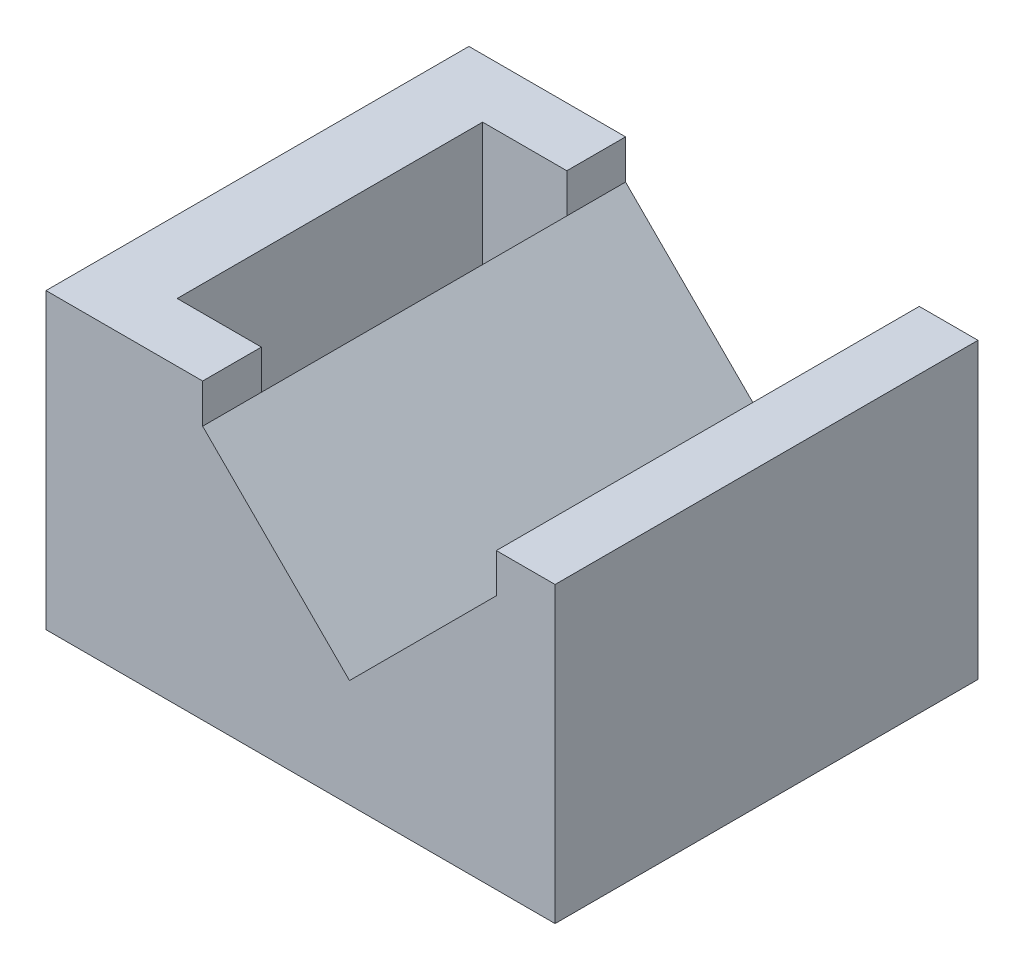
ISO-10303-21;
HEADER;
FILE_DESCRIPTION(('STEP AP214'),'2;1');
FILE_NAME('part.step','',(''),(''),'','','');
FILE_SCHEMA(('AUTOMOTIVE_DESIGN { 1 0 10303 214 1 1 1 1 }'));
ENDSEC;
DATA;
#1=APPLICATION_CONTEXT('core data for automotive mechanical design processes');
#2=APPLICATION_PROTOCOL_DEFINITION('international standard','automotive_design',2000,#1);
#3=PRODUCT_CONTEXT('',#1,'mechanical');
#4=PRODUCT('Part','Part','',(#3));
#5=PRODUCT_RELATED_PRODUCT_CATEGORY('part','',(#4));
#6=PRODUCT_DEFINITION_FORMATION('','',#4);
#7=PRODUCT_DEFINITION_CONTEXT('part definition',#1,'design');
#8=PRODUCT_DEFINITION('design','',#6,#7);
#9=PRODUCT_DEFINITION_SHAPE('','',#8);
#10=(LENGTH_UNIT() NAMED_UNIT(*) SI_UNIT(.MILLI.,.METRE.));
#11=(NAMED_UNIT(*) PLANE_ANGLE_UNIT() SI_UNIT($,.RADIAN.));
#12=(NAMED_UNIT(*) SI_UNIT($,.STERADIAN.) SOLID_ANGLE_UNIT());
#13=UNCERTAINTY_MEASURE_WITH_UNIT(LENGTH_MEASURE(1.E-05),#10,'distance_accuracy_value','');
#14=(GEOMETRIC_REPRESENTATION_CONTEXT(3) GLOBAL_UNCERTAINTY_ASSIGNED_CONTEXT((#13)) GLOBAL_UNIT_ASSIGNED_CONTEXT((#10,
#11,#12)) REPRESENTATION_CONTEXT('',''));
#15=CARTESIAN_POINT('',(0.,0.,0.));
#16=DIRECTION('',(0.,0.,1.));
#17=DIRECTION('',(1.,0.,0.));
#18=AXIS2_PLACEMENT_3D('',#15,#16,#17);
#19=CARTESIAN_POINT('',(8.,13.,25.));
#20=DIRECTION('',(-1.,0.,0.));
#21=DIRECTION('',(0.,-1.,0.));
#22=AXIS2_PLACEMENT_3D('',#19,#20,#21);
#23=PLANE('',#22);
#24=DIRECTION('',(0.,0.,-1.));
#25=VECTOR('',#24,1.);
#26=CARTESIAN_POINT('',(7.99999999999999,15.,25.));
#27=LINE('',#26,#25);
#28=CARTESIAN_POINT('',(7.99999999999999,15.,10.8));
#29=VERTEX_POINT('',#28);
#30=CARTESIAN_POINT('',(8.,15.,7.8));
#31=VERTEX_POINT('',#30);
#32=EDGE_CURVE('E305',#29,#31,#27,.T.);
#33=ORIENTED_EDGE('',*,*,#32,.F.);
#34=DIRECTION('',(0.,-1.,0.));
#35=VECTOR('',#34,1.);
#36=CARTESIAN_POINT('',(8.,13.,10.8));
#37=LINE('',#36,#35);
#38=CARTESIAN_POINT('',(8.,13.,10.8));
#39=VERTEX_POINT('',#38);
#40=EDGE_CURVE('E224',#29,#39,#37,.T.);
#41=ORIENTED_EDGE('',*,*,#40,.T.);
#42=DIRECTION('',(0.,0.,-1.));
#43=VECTOR('',#42,1.);
#44=CARTESIAN_POINT('',(8.,13.,25.));
#45=LINE('',#44,#43);
#46=CARTESIAN_POINT('',(8.,13.,7.8));
#47=VERTEX_POINT('',#46);
#48=EDGE_CURVE('E308',#39,#47,#45,.T.);
#49=ORIENTED_EDGE('',*,*,#48,.T.);
#50=DIRECTION('',(0.,1.,0.));
#51=VECTOR('',#50,1.);
#52=CARTESIAN_POINT('',(8.,0.,7.8));
#53=LINE('',#52,#51);
#54=EDGE_CURVE('E274',#47,#31,#53,.T.);
#55=ORIENTED_EDGE('',*,*,#54,.T.);
#56=EDGE_LOOP('',(#33,#41,#49,#55));
#57=FACE_BOUND('',#56,.T.);
#58=ADVANCED_FACE('F33',(#57),#23,.F.);
#59=CARTESIAN_POINT('',(26.,0.,25.));
#60=DIRECTION('',(-1.,0.,0.));
#61=DIRECTION('',(0.,0.,1.));
#62=AXIS2_PLACEMENT_3D('',#59,#60,#61);
#63=PLANE('',#62);
#64=DIRECTION('',(0.,0.,-1.));
#65=VECTOR('',#64,1.);
#66=CARTESIAN_POINT('',(26.,0.,25.));
#67=LINE('',#66,#65);
#68=CARTESIAN_POINT('',(26.,0.,10.8));
#69=VERTEX_POINT('',#68);
#70=CARTESIAN_POINT('',(26.,0.,-10.8));
#71=VERTEX_POINT('',#70);
#72=EDGE_CURVE('E295',#69,#71,#67,.T.);
#73=ORIENTED_EDGE('',*,*,#72,.T.);
#74=DIRECTION('',(0.,1.,0.));
#75=VECTOR('',#74,1.);
#76=CARTESIAN_POINT('',(26.,0.,-10.8));
#77=LINE('',#76,#75);
#78=CARTESIAN_POINT('',(26.,15.,-10.8));
#79=VERTEX_POINT('',#78);
#80=EDGE_CURVE('E211',#71,#79,#77,.T.);
#81=ORIENTED_EDGE('',*,*,#80,.T.);
#82=DIRECTION('',(0.,0.,-1.));
#83=VECTOR('',#82,1.);
#84=CARTESIAN_POINT('',(26.,15.,25.));
#85=LINE('',#84,#83);
#86=CARTESIAN_POINT('',(26.,15.,10.8));
#87=VERTEX_POINT('',#86);
#88=EDGE_CURVE('E11',#87,#79,#85,.T.);
#89=ORIENTED_EDGE('',*,*,#88,.F.);
#90=DIRECTION('',(0.,1.,0.));
#91=VECTOR('',#90,1.);
#92=CARTESIAN_POINT('',(26.,0.,10.8));
#93=LINE('',#92,#91);
#94=EDGE_CURVE('E218',#69,#87,#93,.T.);
#95=ORIENTED_EDGE('',*,*,#94,.F.);
#96=EDGE_LOOP('',(#73,#81,#89,#95));
#97=FACE_BOUND('',#96,.T.);
#98=ADVANCED_FACE('F35',(#97),#63,.F.);
#99=CARTESIAN_POINT('',(23.,15.,25.));
#100=DIRECTION('',(0.,-1.,0.));
#101=DIRECTION('',(1.,0.,0.));
#102=AXIS2_PLACEMENT_3D('',#99,#100,#101);
#103=PLANE('',#102);
#104=ORIENTED_EDGE('',*,*,#88,.T.);
#105=DIRECTION('',(-1.,0.,0.));
#106=VECTOR('',#105,1.);
#107=CARTESIAN_POINT('',(23.,15.,-10.8));
#108=LINE('',#107,#106);
#109=CARTESIAN_POINT('',(23.,15.,-10.8));
#110=VERTEX_POINT('',#109);
#111=EDGE_CURVE('E254',#79,#110,#108,.T.);
#112=ORIENTED_EDGE('',*,*,#111,.T.);
#113=DIRECTION('',(0.,0.,-1.));
#114=VECTOR('',#113,1.);
#115=CARTESIAN_POINT('',(23.,15.,25.));
#116=LINE('',#115,#114);
#117=CARTESIAN_POINT('',(23.,15.,10.8));
#118=VERTEX_POINT('',#117);
#119=EDGE_CURVE('E41',#118,#110,#116,.T.);
#120=ORIENTED_EDGE('',*,*,#119,.F.);
#121=DIRECTION('',(1.,0.,0.));
#122=VECTOR('',#121,1.);
#123=CARTESIAN_POINT('',(23.,15.,10.8));
#124=LINE('',#123,#122);
#125=EDGE_CURVE('E236',#118,#87,#124,.T.);
#126=ORIENTED_EDGE('',*,*,#125,.T.);
#127=EDGE_LOOP('',(#104,#112,#120,#126));
#128=FACE_BOUND('',#127,.T.);
#129=ADVANCED_FACE('F321',(#128),#103,.F.);
#130=CARTESIAN_POINT('',(23.,13.,25.));
#131=DIRECTION('',(1.,0.,0.));
#132=DIRECTION('',(0.,0.,-1.));
#133=AXIS2_PLACEMENT_3D('',#130,#131,#132);
#134=PLANE('',#133);
#135=ORIENTED_EDGE('',*,*,#119,.T.);
#136=DIRECTION('',(0.,-1.,0.));
#137=VECTOR('',#136,1.);
#138=CARTESIAN_POINT('',(23.,13.,-10.8));
#139=LINE('',#138,#137);
#140=CARTESIAN_POINT('',(23.,13.,-10.8));
#141=VERTEX_POINT('',#140);
#142=EDGE_CURVE('E251',#110,#141,#139,.T.);
#143=ORIENTED_EDGE('',*,*,#142,.T.);
#144=DIRECTION('',(0.,0.,-1.));
#145=VECTOR('',#144,1.);
#146=CARTESIAN_POINT('',(23.,13.,25.));
#147=LINE('',#146,#145);
#148=CARTESIAN_POINT('',(23.,13.,10.8));
#149=VERTEX_POINT('',#148);
#150=EDGE_CURVE('E313',#149,#141,#147,.T.);
#151=ORIENTED_EDGE('',*,*,#150,.F.);
#152=DIRECTION('',(0.,1.,0.));
#153=VECTOR('',#152,1.);
#154=CARTESIAN_POINT('',(23.,13.,10.8));
#155=LINE('',#154,#153);
#156=EDGE_CURVE('E233',#149,#118,#155,.T.);
#157=ORIENTED_EDGE('',*,*,#156,.T.);
#158=EDGE_LOOP('',(#135,#143,#151,#157));
#159=FACE_BOUND('',#158,.T.);
#160=ADVANCED_FACE('F318',(#159),#134,.F.);
#161=CARTESIAN_POINT('',(23.,13.,25.));
#162=DIRECTION('',(0.707106781186548,-0.707106781186547,0.));
#163=DIRECTION('',(0.707106781186547,0.707106781186548,0.));
#164=AXIS2_PLACEMENT_3D('',#161,#162,#163);
#165=PLANE('',#164);
#166=ORIENTED_EDGE('',*,*,#150,.T.);
#167=DIRECTION('',(-0.707106781186547,-0.707106781186548,0.));
#168=VECTOR('',#167,1.);
#169=CARTESIAN_POINT('',(23.,13.,-10.8));
#170=LINE('',#169,#168);
#171=CARTESIAN_POINT('',(15.5,5.5,-10.8));
#172=VERTEX_POINT('',#171);
#173=EDGE_CURVE('E248',#141,#172,#170,.T.);
#174=ORIENTED_EDGE('',*,*,#173,.T.);
#175=DIRECTION('',(0.,0.,-1.));
#176=VECTOR('',#175,1.);
#177=CARTESIAN_POINT('',(15.5,5.5,25.));
#178=LINE('',#177,#176);
#179=CARTESIAN_POINT('',(15.5,5.5,10.8));
#180=VERTEX_POINT('',#179);
#181=EDGE_CURVE('E310',#180,#172,#178,.T.);
#182=ORIENTED_EDGE('',*,*,#181,.F.);
#183=DIRECTION('',(0.707106781186547,0.707106781186548,0.));
#184=VECTOR('',#183,1.);
#185=CARTESIAN_POINT('',(23.,13.,10.8));
#186=LINE('',#185,#184);
#187=EDGE_CURVE('E230',#180,#149,#186,.T.);
#188=ORIENTED_EDGE('',*,*,#187,.T.);
#189=EDGE_LOOP('',(#166,#174,#182,#188));
#190=FACE_BOUND('',#189,.T.);
#191=ADVANCED_FACE('F350',(#190),#165,.F.);
#192=CARTESIAN_POINT('',(15.5,5.5,25.));
#193=DIRECTION('',(-0.707106781186548,-0.707106781186547,0.));
#194=DIRECTION('',(0.707106781186547,-0.707106781186548,0.));
#195=AXIS2_PLACEMENT_3D('',#192,#193,#194);
#196=PLANE('',#195);
#197=ORIENTED_EDGE('',*,*,#181,.T.);
#198=DIRECTION('',(-0.707106781186547,0.707106781186548,0.));
#199=VECTOR('',#198,1.);
#200=CARTESIAN_POINT('',(15.5,5.5,-10.8));
#201=LINE('',#200,#199);
#202=CARTESIAN_POINT('',(8.,13.,-10.8));
#203=VERTEX_POINT('',#202);
#204=EDGE_CURVE('E245',#172,#203,#201,.T.);
#205=ORIENTED_EDGE('',*,*,#204,.T.);
#206=CARTESIAN_POINT('',(8.,13.,-7.8));
#207=VERTEX_POINT('',#206);
#208=EDGE_CURVE('E307',#207,#203,#45,.T.);
#209=ORIENTED_EDGE('',*,*,#208,.F.);
#210=DIRECTION('',(0.,0.,1.));
#211=VECTOR('',#210,1.);
#212=CARTESIAN_POINT('',(8.,13.,25.));
#213=LINE('',#212,#211);
#214=EDGE_CURVE('E292',#207,#47,#213,.T.);
#215=ORIENTED_EDGE('',*,*,#214,.T.);
#216=ORIENTED_EDGE('',*,*,#48,.F.);
#217=DIRECTION('',(0.707106781186547,-0.707106781186548,0.));
#218=VECTOR('',#217,1.);
#219=CARTESIAN_POINT('',(15.5,5.5,10.8));
#220=LINE('',#219,#218);
#221=EDGE_CURVE('E227',#39,#180,#220,.T.);
#222=ORIENTED_EDGE('',*,*,#221,.T.);
#223=EDGE_LOOP('',(#197,#205,#209,#215,#216,#222));
#224=FACE_BOUND('',#223,.T.);
#225=ADVANCED_FACE('F346',(#224),#196,.F.);
#226=ORIENTED_EDGE('',*,*,#208,.T.);
#227=DIRECTION('',(0.,1.,0.));
#228=VECTOR('',#227,1.);
#229=CARTESIAN_POINT('',(8.,13.,-10.8));
#230=LINE('',#229,#228);
#231=CARTESIAN_POINT('',(7.99999999999999,15.,-10.8));
#232=VERTEX_POINT('',#231);
#233=EDGE_CURVE('E242',#203,#232,#230,.T.);
#234=ORIENTED_EDGE('',*,*,#233,.T.);
#235=CARTESIAN_POINT('',(7.99999999999999,15.,-7.79999999999999));
#236=VERTEX_POINT('',#235);
#237=EDGE_CURVE('E304',#236,#232,#27,.T.);
#238=ORIENTED_EDGE('',*,*,#237,.F.);
#239=DIRECTION('',(0.,1.,0.));
#240=VECTOR('',#239,1.);
#241=CARTESIAN_POINT('',(8.,0.,-7.8));
#242=LINE('',#241,#240);
#243=EDGE_CURVE('E269',#207,#236,#242,.T.);
#244=ORIENTED_EDGE('',*,*,#243,.F.);
#245=EDGE_LOOP('',(#226,#234,#238,#244));
#246=FACE_BOUND('',#245,.T.);
#247=ADVANCED_FACE('F342',(#246),#23,.F.);
#248=CARTESIAN_POINT('',(7.99999999999999,15.,25.));
#249=DIRECTION('',(0.,-1.,0.));
#250=DIRECTION('',(1.,0.,0.));
#251=AXIS2_PLACEMENT_3D('',#248,#249,#250);
#252=PLANE('',#251);
#253=ORIENTED_EDGE('',*,*,#237,.T.);
#254=DIRECTION('',(-1.,0.,0.));
#255=VECTOR('',#254,1.);
#256=CARTESIAN_POINT('',(7.99999999999999,15.,-10.8));
#257=LINE('',#256,#255);
#258=CARTESIAN_POINT('',(0.,15.,-10.8));
#259=VERTEX_POINT('',#258);
#260=EDGE_CURVE('E239',#232,#259,#257,.T.);
#261=ORIENTED_EDGE('',*,*,#260,.T.);
#262=DIRECTION('',(0.,0.,-1.));
#263=VECTOR('',#262,1.);
#264=CARTESIAN_POINT('',(0.,15.,25.));
#265=LINE('',#264,#263);
#266=CARTESIAN_POINT('',(0.,15.,10.8));
#267=VERTEX_POINT('',#266);
#268=EDGE_CURVE('E301',#267,#259,#265,.T.);
#269=ORIENTED_EDGE('',*,*,#268,.F.);
#270=DIRECTION('',(1.,0.,0.));
#271=VECTOR('',#270,1.);
#272=CARTESIAN_POINT('',(7.99999999999999,15.,10.8));
#273=LINE('',#272,#271);
#274=EDGE_CURVE('E214',#267,#29,#273,.T.);
#275=ORIENTED_EDGE('',*,*,#274,.T.);
#276=ORIENTED_EDGE('',*,*,#32,.T.);
#277=DIRECTION('',(-1.,0.,0.));
#278=VECTOR('',#277,1.);
#279=CARTESIAN_POINT('',(7.99999999999999,15.,7.8));
#280=LINE('',#279,#278);
#281=CARTESIAN_POINT('',(3.7,15.,7.8));
#282=VERTEX_POINT('',#281);
#283=EDGE_CURVE('E289',#31,#282,#280,.T.);
#284=ORIENTED_EDGE('',*,*,#283,.T.);
#285=DIRECTION('',(0.,0.,-1.));
#286=VECTOR('',#285,1.);
#287=CARTESIAN_POINT('',(3.7,15.,25.));
#288=LINE('',#287,#286);
#289=CARTESIAN_POINT('',(3.7,15.,-7.79999999999999));
#290=VERTEX_POINT('',#289);
#291=EDGE_CURVE('E286',#282,#290,#288,.T.);
#292=ORIENTED_EDGE('',*,*,#291,.T.);
#293=DIRECTION('',(1.,0.,0.));
#294=VECTOR('',#293,1.);
#295=CARTESIAN_POINT('',(7.99999999999994,15.,-7.8));
#296=LINE('',#295,#294);
#297=EDGE_CURVE('E273',#290,#236,#296,.T.);
#298=ORIENTED_EDGE('',*,*,#297,.T.);
#299=EDGE_LOOP('',(#253,#261,#269,#275,#276,#284,#292,#298));
#300=FACE_BOUND('',#299,.T.);
#301=ADVANCED_FACE('F337',(#300),#252,.F.);
#302=CARTESIAN_POINT('',(0.,15.,25.));
#303=DIRECTION('',(1.,0.,0.));
#304=DIRECTION('',(0.,1.,0.));
#305=AXIS2_PLACEMENT_3D('',#302,#303,#304);
#306=PLANE('',#305);
#307=DIRECTION('',(0.,0.,-1.));
#308=VECTOR('',#307,1.);
#309=CARTESIAN_POINT('',(0.,8.5,2.5));
#310=LINE('',#309,#308);
#311=CARTESIAN_POINT('',(0.,8.5,2.5));
#312=VERTEX_POINT('',#311);
#313=CARTESIAN_POINT('',(0.,8.5,-2.5));
#314=VERTEX_POINT('',#313);
#315=EDGE_CURVE('E48',#312,#314,#310,.T.);
#316=ORIENTED_EDGE('',*,*,#315,.F.);
#317=DIRECTION('',(0.,1.,0.));
#318=VECTOR('',#317,1.);
#319=CARTESIAN_POINT('',(0.,8.5,2.5));
#320=LINE('',#319,#318);
#321=CARTESIAN_POINT('',(0.,4.,2.5));
#322=VERTEX_POINT('',#321);
#323=EDGE_CURVE('E53',#322,#312,#320,.T.);
#324=ORIENTED_EDGE('',*,*,#323,.F.);
#325=DIRECTION('',(0.,0.,-1.));
#326=VECTOR('',#325,1.);
#327=CARTESIAN_POINT('',(0.,4.,2.5));
#328=LINE('',#327,#326);
#329=CARTESIAN_POINT('',(0.,4.,-2.5));
#330=VERTEX_POINT('',#329);
#331=EDGE_CURVE('E188',#322,#330,#328,.T.);
#332=ORIENTED_EDGE('',*,*,#331,.T.);
#333=DIRECTION('',(0.,1.,0.));
#334=VECTOR('',#333,1.);
#335=CARTESIAN_POINT('',(0.,8.5,-2.5));
#336=LINE('',#335,#334);
#337=EDGE_CURVE('E189',#330,#314,#336,.T.);
#338=ORIENTED_EDGE('',*,*,#337,.T.);
#339=EDGE_LOOP('',(#316,#324,#332,#338));
#340=FACE_BOUND('',#339,.T.);
#341=ORIENTED_EDGE('',*,*,#268,.T.);
#342=DIRECTION('',(0.,1.,0.));
#343=VECTOR('',#342,1.);
#344=CARTESIAN_POINT('',(0.,0.,-10.8));
#345=LINE('',#344,#343);
#346=CARTESIAN_POINT('',(0.,0.,-10.8));
#347=VERTEX_POINT('',#346);
#348=EDGE_CURVE('E209',#347,#259,#345,.T.);
#349=ORIENTED_EDGE('',*,*,#348,.F.);
#350=DIRECTION('',(0.,0.,-1.));
#351=VECTOR('',#350,1.);
#352=CARTESIAN_POINT('',(0.,0.,25.));
#353=LINE('',#352,#351);
#354=CARTESIAN_POINT('',(0.,0.,10.8));
#355=VERTEX_POINT('',#354);
#356=EDGE_CURVE('E298',#355,#347,#353,.T.);
#357=ORIENTED_EDGE('',*,*,#356,.F.);
#358=DIRECTION('',(0.,1.,0.));
#359=VECTOR('',#358,1.);
#360=CARTESIAN_POINT('',(0.,0.,10.8));
#361=LINE('',#360,#359);
#362=EDGE_CURVE('E210',#355,#267,#361,.T.);
#363=ORIENTED_EDGE('',*,*,#362,.T.);
#364=EDGE_LOOP('',(#341,#349,#357,#363));
#365=FACE_BOUND('',#364,.T.);
#366=ADVANCED_FACE('F333',(#340,#365),#306,.F.);
#367=CARTESIAN_POINT('',(26.,0.,25.));
#368=DIRECTION('',(0.,1.,0.));
#369=DIRECTION('',(-1.,0.,0.));
#370=AXIS2_PLACEMENT_3D('',#367,#368,#369);
#371=PLANE('',#370);
#372=DIRECTION('',(1.,0.,0.));
#373=VECTOR('',#372,1.);
#374=CARTESIAN_POINT('',(8.,0.,7.8));
#375=LINE('',#374,#373);
#376=CARTESIAN_POINT('',(3.70000000000001,0.,7.8));
#377=VERTEX_POINT('',#376);
#378=CARTESIAN_POINT('',(8.,0.,7.8));
#379=VERTEX_POINT('',#378);
#380=EDGE_CURVE('E266',#377,#379,#375,.T.);
#381=ORIENTED_EDGE('',*,*,#380,.T.);
#382=DIRECTION('',(0.,0.,-1.));
#383=VECTOR('',#382,1.);
#384=CARTESIAN_POINT('',(8.,0.,-7.8));
#385=LINE('',#384,#383);
#386=CARTESIAN_POINT('',(8.,0.,-7.8));
#387=VERTEX_POINT('',#386);
#388=EDGE_CURVE('E257',#379,#387,#385,.T.);
#389=ORIENTED_EDGE('',*,*,#388,.T.);
#390=DIRECTION('',(-1.,0.,0.));
#391=VECTOR('',#390,1.);
#392=CARTESIAN_POINT('',(8.,0.,-7.8));
#393=LINE('',#392,#391);
#394=CARTESIAN_POINT('',(3.7,0.,-7.79999999999999));
#395=VERTEX_POINT('',#394);
#396=EDGE_CURVE('E260',#387,#395,#393,.T.);
#397=ORIENTED_EDGE('',*,*,#396,.T.);
#398=DIRECTION('',(0.,0.,1.));
#399=VECTOR('',#398,1.);
#400=CARTESIAN_POINT('',(3.7,0.,-7.79999999999999));
#401=LINE('',#400,#399);
#402=EDGE_CURVE('E263',#395,#377,#401,.T.);
#403=ORIENTED_EDGE('',*,*,#402,.T.);
#404=EDGE_LOOP('',(#381,#389,#397,#403));
#405=FACE_BOUND('',#404,.T.);
#406=ORIENTED_EDGE('',*,*,#356,.T.);
#407=DIRECTION('',(1.,0.,0.));
#408=VECTOR('',#407,1.);
#409=CARTESIAN_POINT('',(0.,0.,-10.8));
#410=LINE('',#409,#408);
#411=EDGE_CURVE('E206',#347,#71,#410,.T.);
#412=ORIENTED_EDGE('',*,*,#411,.T.);
#413=ORIENTED_EDGE('',*,*,#72,.F.);
#414=DIRECTION('',(-1.,0.,0.));
#415=VECTOR('',#414,1.);
#416=CARTESIAN_POINT('',(0.,0.,10.8));
#417=LINE('',#416,#415);
#418=EDGE_CURVE('E205',#69,#355,#417,.T.);
#419=ORIENTED_EDGE('',*,*,#418,.T.);
#420=EDGE_LOOP('',(#406,#412,#413,#419));
#421=FACE_BOUND('',#420,.T.);
#422=ADVANCED_FACE('F329',(#405,#421),#371,.F.);
#423=CARTESIAN_POINT('',(8.,0.,-7.8));
#424=DIRECTION('',(1.,0.,0.));
#425=DIRECTION('',(0.,1.,0.));
#426=AXIS2_PLACEMENT_3D('',#423,#424,#425);
#427=PLANE('',#426);
#428=EDGE_CURVE('E281',#387,#207,#242,.T.);
#429=ORIENTED_EDGE('',*,*,#428,.F.);
#430=ORIENTED_EDGE('',*,*,#388,.F.);
#431=EDGE_CURVE('E270',#379,#47,#53,.T.);
#432=ORIENTED_EDGE('',*,*,#431,.T.);
#433=ORIENTED_EDGE('',*,*,#214,.F.);
#434=EDGE_LOOP('',(#429,#430,#432,#433));
#435=FACE_BOUND('',#434,.T.);
#436=ADVANCED_FACE('F362',(#435),#427,.F.);
#437=CARTESIAN_POINT('',(8.,0.,7.8));
#438=DIRECTION('',(0.,0.,1.));
#439=DIRECTION('',(1.,0.,0.));
#440=AXIS2_PLACEMENT_3D('',#437,#438,#439);
#441=PLANE('',#440);
#442=ORIENTED_EDGE('',*,*,#54,.F.);
#443=ORIENTED_EDGE('',*,*,#431,.F.);
#444=ORIENTED_EDGE('',*,*,#380,.F.);
#445=DIRECTION('',(0.,1.,0.));
#446=VECTOR('',#445,1.);
#447=CARTESIAN_POINT('',(3.70000000000001,0.,7.8));
#448=LINE('',#447,#446);
#449=EDGE_CURVE('E275',#377,#282,#448,.T.);
#450=ORIENTED_EDGE('',*,*,#449,.T.);
#451=ORIENTED_EDGE('',*,*,#283,.F.);
#452=EDGE_LOOP('',(#442,#443,#444,#450,#451));
#453=FACE_BOUND('',#452,.T.);
#454=ADVANCED_FACE('F358',(#453),#441,.F.);
#455=CARTESIAN_POINT('',(3.7,0.,-7.79999999999999));
#456=DIRECTION('',(-1.,0.,0.));
#457=DIRECTION('',(0.,-1.,0.));
#458=AXIS2_PLACEMENT_3D('',#455,#456,#457);
#459=PLANE('',#458);
#460=ORIENTED_EDGE('',*,*,#449,.F.);
#461=ORIENTED_EDGE('',*,*,#402,.F.);
#462=DIRECTION('',(0.,1.,0.));
#463=VECTOR('',#462,1.);
#464=CARTESIAN_POINT('',(3.7,0.,-7.79999999999999));
#465=LINE('',#464,#463);
#466=EDGE_CURVE('E278',#395,#290,#465,.T.);
#467=ORIENTED_EDGE('',*,*,#466,.T.);
#468=ORIENTED_EDGE('',*,*,#291,.F.);
#469=EDGE_LOOP('',(#460,#461,#467,#468));
#470=FACE_BOUND('',#469,.T.);
#471=ADVANCED_FACE('F366',(#470),#459,.F.);
#472=CARTESIAN_POINT('',(8.,0.,-7.8));
#473=DIRECTION('',(0.,0.,-1.));
#474=DIRECTION('',(-1.,0.,0.));
#475=AXIS2_PLACEMENT_3D('',#472,#473,#474);
#476=PLANE('',#475);
#477=ORIENTED_EDGE('',*,*,#466,.F.);
#478=ORIENTED_EDGE('',*,*,#396,.F.);
#479=ORIENTED_EDGE('',*,*,#428,.T.);
#480=ORIENTED_EDGE('',*,*,#243,.T.);
#481=ORIENTED_EDGE('',*,*,#297,.F.);
#482=EDGE_LOOP('',(#477,#478,#479,#480,#481));
#483=FACE_BOUND('',#482,.T.);
#484=ADVANCED_FACE('F369',(#483),#476,.F.);
#485=CARTESIAN_POINT('',(0.,0.,10.8));
#486=DIRECTION('',(0.,0.,-1.));
#487=DIRECTION('',(-1.,0.,0.));
#488=AXIS2_PLACEMENT_3D('',#485,#486,#487);
#489=PLANE('',#488);
#490=ORIENTED_EDGE('',*,*,#156,.F.);
#491=ORIENTED_EDGE('',*,*,#187,.F.);
#492=ORIENTED_EDGE('',*,*,#221,.F.);
#493=ORIENTED_EDGE('',*,*,#40,.F.);
#494=ORIENTED_EDGE('',*,*,#274,.F.);
#495=ORIENTED_EDGE('',*,*,#362,.F.);
#496=ORIENTED_EDGE('',*,*,#418,.F.);
#497=ORIENTED_EDGE('',*,*,#94,.T.);
#498=ORIENTED_EDGE('',*,*,#125,.F.);
#499=EDGE_LOOP('',(#490,#491,#492,#493,#494,#495,#496,#497,#498));
#500=FACE_BOUND('',#499,.T.);
#501=ADVANCED_FACE('F352',(#500),#489,.F.);
#502=CARTESIAN_POINT('',(0.,0.,-10.8));
#503=DIRECTION('',(0.,0.,1.));
#504=DIRECTION('',(1.,0.,0.));
#505=AXIS2_PLACEMENT_3D('',#502,#503,#504);
#506=PLANE('',#505);
#507=ORIENTED_EDGE('',*,*,#80,.F.);
#508=ORIENTED_EDGE('',*,*,#411,.F.);
#509=ORIENTED_EDGE('',*,*,#348,.T.);
#510=ORIENTED_EDGE('',*,*,#260,.F.);
#511=ORIENTED_EDGE('',*,*,#233,.F.);
#512=ORIENTED_EDGE('',*,*,#204,.F.);
#513=ORIENTED_EDGE('',*,*,#173,.F.);
#514=ORIENTED_EDGE('',*,*,#142,.F.);
#515=ORIENTED_EDGE('',*,*,#111,.F.);
#516=EDGE_LOOP('',(#507,#508,#509,#510,#511,#512,#513,#514,#515));
#517=FACE_BOUND('',#516,.T.);
#518=ADVANCED_FACE('F324',(#517),#506,.F.);
#519=CARTESIAN_POINT('',(0.,8.5,2.5));
#520=DIRECTION('',(0.832050294337844,-0.554700196225229,0.));
#521=DIRECTION('',(0.554700196225229,0.832050294337844,0.));
#522=AXIS2_PLACEMENT_3D('',#519,#520,#521);
#523=PLANE('',#522);
#524=DIRECTION('',(-0.554700196225229,-0.832050294337844,0.));
#525=VECTOR('',#524,1.);
#526=CARTESIAN_POINT('',(0.,8.5,-2.5));
#527=LINE('',#526,#525);
#528=CARTESIAN_POINT('',(-3.,4.,-2.5));
#529=VERTEX_POINT('',#528);
#530=EDGE_CURVE('E173',#314,#529,#527,.T.);
#531=ORIENTED_EDGE('',*,*,#530,.T.);
#532=DIRECTION('',(0.,0.,-1.));
#533=VECTOR('',#532,1.);
#534=CARTESIAN_POINT('',(-3.,4.,2.5));
#535=LINE('',#534,#533);
#536=CARTESIAN_POINT('',(-3.,4.,2.5));
#537=VERTEX_POINT('',#536);
#538=EDGE_CURVE('E170',#537,#529,#535,.T.);
#539=ORIENTED_EDGE('',*,*,#538,.F.);
#540=DIRECTION('',(-0.554700196225229,-0.832050294337844,0.));
#541=VECTOR('',#540,1.);
#542=CARTESIAN_POINT('',(0.,8.5,2.5));
#543=LINE('',#542,#541);
#544=EDGE_CURVE('E161',#312,#537,#543,.T.);
#545=ORIENTED_EDGE('',*,*,#544,.F.);
#546=ORIENTED_EDGE('',*,*,#315,.T.);
#547=EDGE_LOOP('',(#531,#539,#545,#546));
#548=FACE_BOUND('',#547,.T.);
#549=ADVANCED_FACE('F171',(#548),#523,.F.);
#550=CARTESIAN_POINT('',(-3.,4.,2.5));
#551=DIRECTION('',(1.,0.,0.));
#552=DIRECTION('',(0.,1.,0.));
#553=AXIS2_PLACEMENT_3D('',#550,#551,#552);
#554=PLANE('',#553);
#555=DIRECTION('',(0.,-1.,0.));
#556=VECTOR('',#555,1.);
#557=CARTESIAN_POINT('',(-3.,4.,-2.5));
#558=LINE('',#557,#556);
#559=CARTESIAN_POINT('',(-3.,1.,-2.5));
#560=VERTEX_POINT('',#559);
#561=EDGE_CURVE('E192',#529,#560,#558,.T.);
#562=ORIENTED_EDGE('',*,*,#561,.T.);
#563=DIRECTION('',(0.,0.,-1.));
#564=VECTOR('',#563,1.);
#565=CARTESIAN_POINT('',(-3.,1.,2.5));
#566=LINE('',#565,#564);
#567=CARTESIAN_POINT('',(-3.,1.,2.5));
#568=VERTEX_POINT('',#567);
#569=EDGE_CURVE('E176',#568,#560,#566,.T.);
#570=ORIENTED_EDGE('',*,*,#569,.F.);
#571=DIRECTION('',(0.,-1.,0.));
#572=VECTOR('',#571,1.);
#573=CARTESIAN_POINT('',(-3.,4.,2.5));
#574=LINE('',#573,#572);
#575=EDGE_CURVE('E165',#537,#568,#574,.T.);
#576=ORIENTED_EDGE('',*,*,#575,.F.);
#577=ORIENTED_EDGE('',*,*,#538,.T.);
#578=EDGE_LOOP('',(#562,#570,#576,#577));
#579=FACE_BOUND('',#578,.T.);
#580=ADVANCED_FACE('F178',(#579),#554,.F.);
#581=CARTESIAN_POINT('',(-3.,1.,2.5));
#582=DIRECTION('',(0.,1.,0.));
#583=DIRECTION('',(0.,0.,1.));
#584=AXIS2_PLACEMENT_3D('',#581,#582,#583);
#585=PLANE('',#584);
#586=DIRECTION('',(1.,0.,0.));
#587=VECTOR('',#586,1.);
#588=CARTESIAN_POINT('',(-3.,1.,-2.5));
#589=LINE('',#588,#587);
#590=CARTESIAN_POINT('',(-2.,1.,-2.5));
#591=VERTEX_POINT('',#590);
#592=EDGE_CURVE('E194',#560,#591,#589,.T.);
#593=ORIENTED_EDGE('',*,*,#592,.T.);
#594=DIRECTION('',(0.,0.,-1.));
#595=VECTOR('',#594,1.);
#596=CARTESIAN_POINT('',(-2.,1.,2.5));
#597=LINE('',#596,#595);
#598=CARTESIAN_POINT('',(-2.,1.,2.5));
#599=VERTEX_POINT('',#598);
#600=EDGE_CURVE('E200',#599,#591,#597,.T.);
#601=ORIENTED_EDGE('',*,*,#600,.F.);
#602=DIRECTION('',(1.,0.,0.));
#603=VECTOR('',#602,1.);
#604=CARTESIAN_POINT('',(-3.,1.,2.5));
#605=LINE('',#604,#603);
#606=EDGE_CURVE('E181',#568,#599,#605,.T.);
#607=ORIENTED_EDGE('',*,*,#606,.F.);
#608=ORIENTED_EDGE('',*,*,#569,.T.);
#609=EDGE_LOOP('',(#593,#601,#607,#608));
#610=FACE_BOUND('',#609,.T.);
#611=ADVANCED_FACE('F497',(#610),#585,.F.);
#612=CARTESIAN_POINT('',(-2.,1.,2.5));
#613=DIRECTION('',(-0.832050294337844,0.554700196225229,0.));
#614=DIRECTION('',(-0.554700196225229,-0.832050294337844,0.));
#615=AXIS2_PLACEMENT_3D('',#612,#613,#614);
#616=PLANE('',#615);
#617=DIRECTION('',(0.554700196225229,0.832050294337844,0.));
#618=VECTOR('',#617,1.);
#619=CARTESIAN_POINT('',(-2.,1.,-2.5));
#620=LINE('',#619,#618);
#621=EDGE_CURVE('E196',#591,#330,#620,.T.);
#622=ORIENTED_EDGE('',*,*,#621,.T.);
#623=ORIENTED_EDGE('',*,*,#331,.F.);
#624=DIRECTION('',(0.554700196225229,0.832050294337844,0.));
#625=VECTOR('',#624,1.);
#626=CARTESIAN_POINT('',(-2.,1.,2.5));
#627=LINE('',#626,#625);
#628=EDGE_CURVE('E183',#599,#322,#627,.T.);
#629=ORIENTED_EDGE('',*,*,#628,.F.);
#630=ORIENTED_EDGE('',*,*,#600,.T.);
#631=EDGE_LOOP('',(#622,#623,#629,#630));
#632=FACE_BOUND('',#631,.T.);
#633=ADVANCED_FACE('F506',(#632),#616,.F.);
#634=CARTESIAN_POINT('',(0.,0.,2.5));
#635=DIRECTION('',(0.,0.,1.));
#636=DIRECTION('',(1.,0.,0.));
#637=AXIS2_PLACEMENT_3D('',#634,#635,#636);
#638=PLANE('',#637);
#639=ORIENTED_EDGE('',*,*,#323,.T.);
#640=ORIENTED_EDGE('',*,*,#544,.T.);
#641=ORIENTED_EDGE('',*,*,#575,.T.);
#642=ORIENTED_EDGE('',*,*,#606,.T.);
#643=ORIENTED_EDGE('',*,*,#628,.T.);
#644=EDGE_LOOP('',(#639,#640,#641,#642,#643));
#645=FACE_BOUND('',#644,.T.);
#646=ADVANCED_FACE('F163',(#645),#638,.T.);
#647=CARTESIAN_POINT('',(0.,0.,-2.5));
#648=DIRECTION('',(0.,0.,1.));
#649=DIRECTION('',(1.,0.,0.));
#650=AXIS2_PLACEMENT_3D('',#647,#648,#649);
#651=PLANE('',#650);
#652=ORIENTED_EDGE('',*,*,#337,.F.);
#653=ORIENTED_EDGE('',*,*,#621,.F.);
#654=ORIENTED_EDGE('',*,*,#592,.F.);
#655=ORIENTED_EDGE('',*,*,#561,.F.);
#656=ORIENTED_EDGE('',*,*,#530,.F.);
#657=EDGE_LOOP('',(#652,#653,#654,#655,#656));
#658=FACE_BOUND('',#657,.T.);
#659=ADVANCED_FACE('F525',(#658),#651,.F.);
#660=CLOSED_SHELL('',(#58,#98,#129,#160,#191,#225,#247,#301,#366,#422,#436,#454,#471,#484,#501,
#518,#549,#580,#611,#633,#646,#659));
#661=MANIFOLD_SOLID_BREP('B2',#660);
#662=ADVANCED_BREP_SHAPE_REPRESENTATION('',(#18,#661),#14);
#663=SHAPE_DEFINITION_REPRESENTATION(#9,#662);
ENDSEC;
END-ISO-10303-21;
